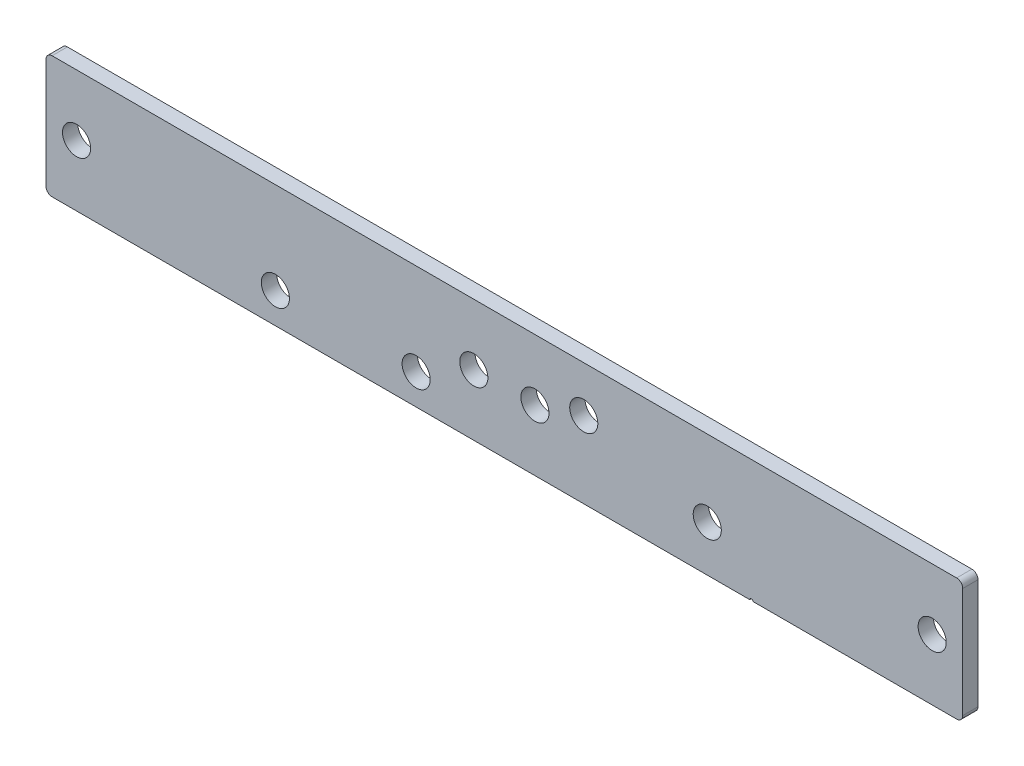
ISO-10303-21;
HEADER;
FILE_DESCRIPTION(('STEP AP214'),'2;1');
FILE_NAME('part.step','',(''),(''),'','','');
FILE_SCHEMA(('AUTOMOTIVE_DESIGN { 1 0 10303 214 1 1 1 1 }'));
ENDSEC;
DATA;
#1=APPLICATION_CONTEXT('core data for automotive mechanical design processes');
#2=APPLICATION_PROTOCOL_DEFINITION('international standard','automotive_design',2000,#1);
#3=PRODUCT_CONTEXT('',#1,'mechanical');
#4=PRODUCT('Part','Part','',(#3));
#5=PRODUCT_RELATED_PRODUCT_CATEGORY('part','',(#4));
#6=PRODUCT_DEFINITION_FORMATION('','',#4);
#7=PRODUCT_DEFINITION_CONTEXT('part definition',#1,'design');
#8=PRODUCT_DEFINITION('design','',#6,#7);
#9=PRODUCT_DEFINITION_SHAPE('','',#8);
#10=(LENGTH_UNIT() NAMED_UNIT(*) SI_UNIT(.MILLI.,.METRE.));
#11=(NAMED_UNIT(*) PLANE_ANGLE_UNIT() SI_UNIT($,.RADIAN.));
#12=(NAMED_UNIT(*) SI_UNIT($,.STERADIAN.) SOLID_ANGLE_UNIT());
#13=UNCERTAINTY_MEASURE_WITH_UNIT(LENGTH_MEASURE(1.E-05),#10,'distance_accuracy_value','');
#14=(GEOMETRIC_REPRESENTATION_CONTEXT(3) GLOBAL_UNCERTAINTY_ASSIGNED_CONTEXT((#13)) GLOBAL_UNIT_ASSIGNED_CONTEXT((#10,
#11,#12)) REPRESENTATION_CONTEXT('',''));
#15=CARTESIAN_POINT('',(0.,0.,0.));
#16=DIRECTION('',(0.,0.,1.));
#17=DIRECTION('',(1.,0.,0.));
#18=AXIS2_PLACEMENT_3D('',#15,#16,#17);
#19=CARTESIAN_POINT('',(-150.,-20.,5.));
#20=DIRECTION('',(0.,1.,0.));
#21=DIRECTION('',(-1.,0.,0.));
#22=AXIS2_PLACEMENT_3D('',#19,#20,#21);
#23=PLANE('',#22);
#24=DIRECTION('',(1.,0.,0.));
#25=VECTOR('',#24,1.);
#26=CARTESIAN_POINT('',(-150.,-20.,5.));
#27=LINE('',#26,#25);
#28=CARTESIAN_POINT('',(81.3290376865498,-20.,5.));
#29=VERTEX_POINT('',#28);
#30=CARTESIAN_POINT('',(148.,-19.9999999999999,5.));
#31=VERTEX_POINT('',#30);
#32=EDGE_CURVE('E117',#29,#31,#27,.T.);
#33=ORIENTED_EDGE('',*,*,#32,.F.);
#34=DIRECTION('',(0.,0.,-1.));
#35=VECTOR('',#34,1.);
#36=CARTESIAN_POINT('',(81.3290376865498,-20.,5.));
#37=LINE('',#36,#35);
#38=CARTESIAN_POINT('',(81.3290376865498,-20.,0.));
#39=VERTEX_POINT('',#38);
#40=EDGE_CURVE('E95',#29,#39,#37,.T.);
#41=ORIENTED_EDGE('',*,*,#40,.T.);
#42=DIRECTION('',(1.,0.,0.));
#43=VECTOR('',#42,1.);
#44=CARTESIAN_POINT('',(-150.,-20.,0.));
#45=LINE('',#44,#43);
#46=CARTESIAN_POINT('',(148.,-19.9999999999999,0.));
#47=VERTEX_POINT('',#46);
#48=EDGE_CURVE('E131',#39,#47,#45,.T.);
#49=ORIENTED_EDGE('',*,*,#48,.T.);
#50=DIRECTION('',(0.,0.,-1.));
#51=VECTOR('',#50,1.);
#52=CARTESIAN_POINT('',(148.,-19.9999999999999,5.));
#53=LINE('',#52,#51);
#54=EDGE_CURVE('E154',#47,#31,#53,.F.);
#55=ORIENTED_EDGE('',*,*,#54,.T.);
#56=EDGE_LOOP('',(#33,#41,#49,#55));
#57=FACE_BOUND('',#56,.T.);
#58=ADVANCED_FACE('F16',(#57),#23,.F.);
#59=CARTESIAN_POINT('',(-150.,20.,5.));
#60=DIRECTION('',(1.,0.,0.));
#61=DIRECTION('',(0.,1.,0.));
#62=AXIS2_PLACEMENT_3D('',#59,#60,#61);
#63=PLANE('',#62);
#64=DIRECTION('',(0.,-1.,0.));
#65=VECTOR('',#64,1.);
#66=CARTESIAN_POINT('',(-150.,20.,0.));
#67=LINE('',#66,#65);
#68=CARTESIAN_POINT('',(-150.,18.,0.));
#69=VERTEX_POINT('',#68);
#70=CARTESIAN_POINT('',(-150.,-18.,0.));
#71=VERTEX_POINT('',#70);
#72=EDGE_CURVE('E128',#69,#71,#67,.T.);
#73=ORIENTED_EDGE('',*,*,#72,.T.);
#74=DIRECTION('',(0.,0.,-1.));
#75=VECTOR('',#74,1.);
#76=CARTESIAN_POINT('',(-150.,-18.,5.));
#77=LINE('',#76,#75);
#78=CARTESIAN_POINT('',(-150.,-18.,5.));
#79=VERTEX_POINT('',#78);
#80=EDGE_CURVE('E10',#71,#79,#77,.F.);
#81=ORIENTED_EDGE('',*,*,#80,.T.);
#82=DIRECTION('',(0.,-1.,0.));
#83=VECTOR('',#82,1.);
#84=CARTESIAN_POINT('',(-150.,20.,5.));
#85=LINE('',#84,#83);
#86=CARTESIAN_POINT('',(-150.,18.,5.));
#87=VERTEX_POINT('',#86);
#88=EDGE_CURVE('E122',#87,#79,#85,.T.);
#89=ORIENTED_EDGE('',*,*,#88,.F.);
#90=DIRECTION('',(0.,0.,-1.));
#91=VECTOR('',#90,1.);
#92=CARTESIAN_POINT('',(-150.,18.,5.));
#93=LINE('',#92,#91);
#94=EDGE_CURVE('E24',#87,#69,#93,.T.);
#95=ORIENTED_EDGE('',*,*,#94,.T.);
#96=EDGE_LOOP('',(#73,#81,#89,#95));
#97=FACE_BOUND('',#96,.T.);
#98=ADVANCED_FACE('F172',(#97),#63,.F.);
#99=CARTESIAN_POINT('',(-148.,-20.,0.));
#100=VERTEX_POINT('',#99);
#101=CARTESIAN_POINT('',(80.3290376865498,-20.,0.));
#102=VERTEX_POINT('',#101);
#103=EDGE_CURVE('E109',#100,#102,#45,.T.);
#104=ORIENTED_EDGE('',*,*,#103,.T.);
#105=DIRECTION('',(0.,0.,-1.));
#106=VECTOR('',#105,1.);
#107=CARTESIAN_POINT('',(80.3290376865498,-20.,5.));
#108=LINE('',#107,#106);
#109=CARTESIAN_POINT('',(80.3290376865498,-20.,5.));
#110=VERTEX_POINT('',#109);
#111=EDGE_CURVE('E31',#102,#110,#108,.F.);
#112=ORIENTED_EDGE('',*,*,#111,.T.);
#113=CARTESIAN_POINT('',(-148.,-20.,5.));
#114=VERTEX_POINT('',#113);
#115=EDGE_CURVE('E106',#114,#110,#27,.T.);
#116=ORIENTED_EDGE('',*,*,#115,.F.);
#117=DIRECTION('',(0.,0.,-1.));
#118=VECTOR('',#117,1.);
#119=CARTESIAN_POINT('',(-148.,-20.,5.));
#120=LINE('',#119,#118);
#121=EDGE_CURVE('E152',#114,#100,#120,.T.);
#122=ORIENTED_EDGE('',*,*,#121,.T.);
#123=EDGE_LOOP('',(#104,#112,#116,#122));
#124=FACE_BOUND('',#123,.T.);
#125=ADVANCED_FACE('F104',(#124),#23,.F.);
#126=CARTESIAN_POINT('',(150.,20.,5.));
#127=DIRECTION('',(-1.,0.,0.));
#128=DIRECTION('',(0.,0.,1.));
#129=AXIS2_PLACEMENT_3D('',#126,#127,#128);
#130=PLANE('',#129);
#131=DIRECTION('',(0.,1.,0.));
#132=VECTOR('',#131,1.);
#133=CARTESIAN_POINT('',(150.,20.,5.));
#134=LINE('',#133,#132);
#135=CARTESIAN_POINT('',(150.,-17.9999999999999,5.));
#136=VERTEX_POINT('',#135);
#137=CARTESIAN_POINT('',(150.,18.,5.));
#138=VERTEX_POINT('',#137);
#139=EDGE_CURVE('E116',#136,#138,#134,.T.);
#140=ORIENTED_EDGE('',*,*,#139,.F.);
#141=DIRECTION('',(0.,0.,-1.));
#142=VECTOR('',#141,1.);
#143=CARTESIAN_POINT('',(150.,-17.9999999999999,5.));
#144=LINE('',#143,#142);
#145=CARTESIAN_POINT('',(150.,-17.9999999999999,0.));
#146=VERTEX_POINT('',#145);
#147=EDGE_CURVE('E140',#136,#146,#144,.T.);
#148=ORIENTED_EDGE('',*,*,#147,.T.);
#149=DIRECTION('',(0.,1.,0.));
#150=VECTOR('',#149,1.);
#151=CARTESIAN_POINT('',(150.,20.,0.));
#152=LINE('',#151,#150);
#153=CARTESIAN_POINT('',(150.,18.,0.));
#154=VERTEX_POINT('',#153);
#155=EDGE_CURVE('E134',#146,#154,#152,.T.);
#156=ORIENTED_EDGE('',*,*,#155,.T.);
#157=DIRECTION('',(0.,0.,-1.));
#158=VECTOR('',#157,1.);
#159=CARTESIAN_POINT('',(150.,18.,5.));
#160=LINE('',#159,#158);
#161=EDGE_CURVE('E127',#154,#138,#160,.F.);
#162=ORIENTED_EDGE('',*,*,#161,.T.);
#163=EDGE_LOOP('',(#140,#148,#156,#162));
#164=FACE_BOUND('',#163,.T.);
#165=ADVANCED_FACE('F202',(#164),#130,.F.);
#166=CARTESIAN_POINT('',(-150.,20.,5.));
#167=DIRECTION('',(0.,-1.,0.));
#168=DIRECTION('',(1.,0.,0.));
#169=AXIS2_PLACEMENT_3D('',#166,#167,#168);
#170=PLANE('',#169);
#171=DIRECTION('',(-1.,0.,0.));
#172=VECTOR('',#171,1.);
#173=CARTESIAN_POINT('',(-150.,20.,5.));
#174=LINE('',#173,#172);
#175=CARTESIAN_POINT('',(148.,20.,5.));
#176=VERTEX_POINT('',#175);
#177=CARTESIAN_POINT('',(-148.,20.,5.));
#178=VERTEX_POINT('',#177);
#179=EDGE_CURVE('E120',#176,#178,#174,.T.);
#180=ORIENTED_EDGE('',*,*,#179,.F.);
#181=DIRECTION('',(0.,0.,-1.));
#182=VECTOR('',#181,1.);
#183=CARTESIAN_POINT('',(148.,20.,5.));
#184=LINE('',#183,#182);
#185=CARTESIAN_POINT('',(148.,20.,0.));
#186=VERTEX_POINT('',#185);
#187=EDGE_CURVE('E165',#176,#186,#184,.T.);
#188=ORIENTED_EDGE('',*,*,#187,.T.);
#189=DIRECTION('',(-1.,0.,0.));
#190=VECTOR('',#189,1.);
#191=CARTESIAN_POINT('',(-150.,20.,0.));
#192=LINE('',#191,#190);
#193=CARTESIAN_POINT('',(-148.,20.,0.));
#194=VERTEX_POINT('',#193);
#195=EDGE_CURVE('E137',#186,#194,#192,.T.);
#196=ORIENTED_EDGE('',*,*,#195,.T.);
#197=DIRECTION('',(0.,0.,-1.));
#198=VECTOR('',#197,1.);
#199=CARTESIAN_POINT('',(-148.,20.,5.));
#200=LINE('',#199,#198);
#201=EDGE_CURVE('E39',#194,#178,#200,.F.);
#202=ORIENTED_EDGE('',*,*,#201,.T.);
#203=EDGE_LOOP('',(#180,#188,#196,#202));
#204=FACE_BOUND('',#203,.T.);
#205=ADVANCED_FACE('F206',(#204),#170,.F.);
#206=CARTESIAN_POINT('',(0.,0.,5.));
#207=DIRECTION('',(0.,0.,1.));
#208=DIRECTION('',(1.,0.,0.));
#209=AXIS2_PLACEMENT_3D('',#206,#207,#208);
#210=PLANE('',#209);
#211=CARTESIAN_POINT('',(80.8290376865498,-20.,5.));
#212=DIRECTION('',(0.,0.,-1.));
#213=DIRECTION('',(-1.,0.,0.));
#214=AXIS2_PLACEMENT_3D('',#211,#212,#213);
#215=CIRCLE('',#214,0.499999999999999);
#216=EDGE_CURVE('E92',#110,#29,#215,.T.);
#217=ORIENTED_EDGE('',*,*,#216,.T.);
#218=ORIENTED_EDGE('',*,*,#32,.T.);
#219=CARTESIAN_POINT('',(148.,-17.9999999999999,5.));
#220=DIRECTION('',(0.,0.,1.));
#221=DIRECTION('',(1.,0.,0.));
#222=AXIS2_PLACEMENT_3D('',#219,#220,#221);
#223=CIRCLE('',#222,2.);
#224=EDGE_CURVE('E162',#31,#136,#223,.T.);
#225=ORIENTED_EDGE('',*,*,#224,.T.);
#226=ORIENTED_EDGE('',*,*,#139,.T.);
#227=CARTESIAN_POINT('',(148.,18.,5.));
#228=DIRECTION('',(0.,0.,1.));
#229=DIRECTION('',(1.,0.,0.));
#230=AXIS2_PLACEMENT_3D('',#227,#228,#229);
#231=CIRCLE('',#230,2.);
#232=EDGE_CURVE('E160',#138,#176,#231,.T.);
#233=ORIENTED_EDGE('',*,*,#232,.T.);
#234=ORIENTED_EDGE('',*,*,#179,.T.);
#235=CARTESIAN_POINT('',(-148.,18.,5.));
#236=DIRECTION('',(0.,0.,1.));
#237=DIRECTION('',(1.,0.,0.));
#238=AXIS2_PLACEMENT_3D('',#235,#236,#237);
#239=CIRCLE('',#238,2.);
#240=EDGE_CURVE('E157',#178,#87,#239,.T.);
#241=ORIENTED_EDGE('',*,*,#240,.T.);
#242=ORIENTED_EDGE('',*,*,#88,.T.);
#243=CARTESIAN_POINT('',(-148.,-18.,5.));
#244=DIRECTION('',(0.,0.,1.));
#245=DIRECTION('',(1.,0.,0.));
#246=AXIS2_PLACEMENT_3D('',#243,#244,#245);
#247=CIRCLE('',#246,2.);
#248=EDGE_CURVE('E115',#79,#114,#247,.T.);
#249=ORIENTED_EDGE('',*,*,#248,.T.);
#250=ORIENTED_EDGE('',*,*,#115,.T.);
#251=EDGE_LOOP('',(#217,#218,#225,#226,#233,#234,#241,#242,#249,#250));
#252=FACE_BOUND('',#251,.T.);
#253=CARTESIAN_POINT('',(-9.99999999999995,0.,5.));
#254=DIRECTION('',(0.,0.,1.));
#255=DIRECTION('',(1.,0.,0.));
#256=AXIS2_PLACEMENT_3D('',#253,#254,#255);
#257=CIRCLE('',#256,4.6);
#258=CARTESIAN_POINT('',(-5.39999999999995,0.,5.));
#259=VERTEX_POINT('',#258);
#260=EDGE_CURVE('E387',#259,#259,#257,.T.);
#261=ORIENTED_EDGE('',*,*,#260,.F.);
#262=EDGE_LOOP('',(#261));
#263=FACE_BOUND('',#262,.T.);
#264=CARTESIAN_POINT('',(10.,0.,5.));
#265=DIRECTION('',(0.,0.,1.));
#266=DIRECTION('',(1.,0.,0.));
#267=AXIS2_PLACEMENT_3D('',#264,#265,#266);
#268=CIRCLE('',#267,4.6);
#269=CARTESIAN_POINT('',(14.6000000000001,0.,5.));
#270=VERTEX_POINT('',#269);
#271=EDGE_CURVE('E395',#270,#270,#268,.T.);
#272=ORIENTED_EDGE('',*,*,#271,.F.);
#273=EDGE_LOOP('',(#272));
#274=FACE_BOUND('',#273,.T.);
#275=CARTESIAN_POINT('',(140.,0.,5.));
#276=DIRECTION('',(0.,0.,1.));
#277=DIRECTION('',(1.,0.,0.));
#278=AXIS2_PLACEMENT_3D('',#275,#276,#277);
#279=CIRCLE('',#278,4.59999999999999);
#280=CARTESIAN_POINT('',(144.6,0.,5.));
#281=VERTEX_POINT('',#280);
#282=EDGE_CURVE('E380',#281,#281,#279,.T.);
#283=ORIENTED_EDGE('',*,*,#282,.F.);
#284=EDGE_LOOP('',(#283));
#285=FACE_BOUND('',#284,.T.);
#286=CARTESIAN_POINT('',(-140.,0.,5.));
#287=DIRECTION('',(0.,0.,1.));
#288=DIRECTION('',(1.,0.,0.));
#289=AXIS2_PLACEMENT_3D('',#286,#287,#288);
#290=CIRCLE('',#289,4.59999999999999);
#291=CARTESIAN_POINT('',(-135.4,0.,5.));
#292=VERTEX_POINT('',#291);
#293=EDGE_CURVE('E394',#292,#292,#290,.T.);
#294=ORIENTED_EDGE('',*,*,#293,.F.);
#295=EDGE_LOOP('',(#294));
#296=FACE_BOUND('',#295,.T.);
#297=CARTESIAN_POINT('',(66.3952809568076,-5.00000000000004,5.));
#298=DIRECTION('',(0.,0.,-1.));
#299=DIRECTION('',(-1.,0.,0.));
#300=AXIS2_PLACEMENT_3D('',#297,#298,#299);
#301=CIRCLE('',#300,4.6);
#302=CARTESIAN_POINT('',(61.7952809568076,-5.00000000000004,5.));
#303=VERTEX_POINT('',#302);
#304=EDGE_CURVE('E408',#303,#303,#301,.T.);
#305=ORIENTED_EDGE('',*,*,#304,.T.);
#306=EDGE_LOOP('',(#305));
#307=FACE_BOUND('',#306,.T.);
#308=CARTESIAN_POINT('',(25.9807621135338,4.99999999999997,5.));
#309=DIRECTION('',(0.,0.,-1.));
#310=DIRECTION('',(-1.,0.,0.));
#311=AXIS2_PLACEMENT_3D('',#308,#309,#310);
#312=CIRCLE('',#311,4.6);
#313=CARTESIAN_POINT('',(21.3807621135338,4.99999999999997,5.));
#314=VERTEX_POINT('',#313);
#315=EDGE_CURVE('E415',#314,#314,#312,.T.);
#316=ORIENTED_EDGE('',*,*,#315,.T.);
#317=EDGE_LOOP('',(#316));
#318=FACE_BOUND('',#317,.T.);
#319=CARTESIAN_POINT('',(-74.9352031786142,-10.,5.));
#320=DIRECTION('',(0.,0.,-1.));
#321=DIRECTION('',(-1.,0.,0.));
#322=AXIS2_PLACEMENT_3D('',#319,#320,#321);
#323=CIRCLE('',#322,4.6);
#324=CARTESIAN_POINT('',(-79.5352031786142,-10.,5.));
#325=VERTEX_POINT('',#324);
#326=EDGE_CURVE('E421',#325,#325,#323,.T.);
#327=ORIENTED_EDGE('',*,*,#326,.T.);
#328=EDGE_LOOP('',(#327));
#329=FACE_BOUND('',#328,.T.);
#330=CARTESIAN_POINT('',(-28.8675134594806,-10.,5.));
#331=DIRECTION('',(0.,0.,-1.));
#332=DIRECTION('',(-1.,0.,0.));
#333=AXIS2_PLACEMENT_3D('',#330,#331,#332);
#334=CIRCLE('',#333,4.6);
#335=CARTESIAN_POINT('',(-33.4675134594806,-10.,5.));
#336=VERTEX_POINT('',#335);
#337=EDGE_CURVE('E132',#336,#336,#334,.T.);
#338=ORIENTED_EDGE('',*,*,#337,.T.);
#339=EDGE_LOOP('',(#338));
#340=FACE_BOUND('',#339,.T.);
#341=ADVANCED_FACE('F111',(#252,#263,#274,#285,#296,#307,#318,#329,#340),#210,.T.);
#342=CARTESIAN_POINT('',(0.,0.,0.));
#343=DIRECTION('',(0.,0.,1.));
#344=DIRECTION('',(1.,0.,0.));
#345=AXIS2_PLACEMENT_3D('',#342,#343,#344);
#346=PLANE('',#345);
#347=CARTESIAN_POINT('',(-9.99999999999995,0.,0.));
#348=DIRECTION('',(0.,0.,1.));
#349=DIRECTION('',(1.,0.,0.));
#350=AXIS2_PLACEMENT_3D('',#347,#348,#349);
#351=CIRCLE('',#350,4.6);
#352=CARTESIAN_POINT('',(-5.39999999999995,0.,0.));
#353=VERTEX_POINT('',#352);
#354=EDGE_CURVE('E390',#353,#353,#351,.F.);
#355=ORIENTED_EDGE('',*,*,#354,.F.);
#356=EDGE_LOOP('',(#355));
#357=FACE_BOUND('',#356,.T.);
#358=CARTESIAN_POINT('',(10.,0.,0.));
#359=DIRECTION('',(0.,0.,1.));
#360=DIRECTION('',(1.,0.,0.));
#361=AXIS2_PLACEMENT_3D('',#358,#359,#360);
#362=CIRCLE('',#361,4.6);
#363=CARTESIAN_POINT('',(14.6000000000001,0.,0.));
#364=VERTEX_POINT('',#363);
#365=EDGE_CURVE('E391',#364,#364,#362,.F.);
#366=ORIENTED_EDGE('',*,*,#365,.F.);
#367=EDGE_LOOP('',(#366));
#368=FACE_BOUND('',#367,.T.);
#369=CARTESIAN_POINT('',(140.,0.,0.));
#370=DIRECTION('',(0.,0.,1.));
#371=DIRECTION('',(1.,0.,0.));
#372=AXIS2_PLACEMENT_3D('',#369,#370,#371);
#373=CIRCLE('',#372,4.59999999999999);
#374=CARTESIAN_POINT('',(144.6,0.,0.));
#375=VERTEX_POINT('',#374);
#376=EDGE_CURVE('E383',#375,#375,#373,.F.);
#377=ORIENTED_EDGE('',*,*,#376,.F.);
#378=EDGE_LOOP('',(#377));
#379=FACE_BOUND('',#378,.T.);
#380=CARTESIAN_POINT('',(-140.,0.,0.));
#381=DIRECTION('',(0.,0.,1.));
#382=DIRECTION('',(1.,0.,0.));
#383=AXIS2_PLACEMENT_3D('',#380,#381,#382);
#384=CIRCLE('',#383,4.59999999999999);
#385=CARTESIAN_POINT('',(-135.4,0.,0.));
#386=VERTEX_POINT('',#385);
#387=EDGE_CURVE('E404',#386,#386,#384,.F.);
#388=ORIENTED_EDGE('',*,*,#387,.F.);
#389=EDGE_LOOP('',(#388));
#390=FACE_BOUND('',#389,.T.);
#391=CARTESIAN_POINT('',(66.3952809568076,-5.00000000000004,0.));
#392=DIRECTION('',(0.,0.,-1.));
#393=DIRECTION('',(-1.,0.,0.));
#394=AXIS2_PLACEMENT_3D('',#391,#392,#393);
#395=CIRCLE('',#394,4.6);
#396=CARTESIAN_POINT('',(61.7952809568076,-5.00000000000004,0.));
#397=VERTEX_POINT('',#396);
#398=EDGE_CURVE('E412',#397,#397,#395,.T.);
#399=ORIENTED_EDGE('',*,*,#398,.F.);
#400=EDGE_LOOP('',(#399));
#401=FACE_BOUND('',#400,.T.);
#402=CARTESIAN_POINT('',(25.9807621135338,4.99999999999997,0.));
#403=DIRECTION('',(0.,0.,-1.));
#404=DIRECTION('',(-1.,0.,0.));
#405=AXIS2_PLACEMENT_3D('',#402,#403,#404);
#406=CIRCLE('',#405,4.6);
#407=CARTESIAN_POINT('',(21.3807621135338,4.99999999999997,0.));
#408=VERTEX_POINT('',#407);
#409=EDGE_CURVE('E418',#408,#408,#406,.T.);
#410=ORIENTED_EDGE('',*,*,#409,.F.);
#411=EDGE_LOOP('',(#410));
#412=FACE_BOUND('',#411,.T.);
#413=CARTESIAN_POINT('',(-74.9352031786142,-10.,0.));
#414=DIRECTION('',(0.,0.,-1.));
#415=DIRECTION('',(-1.,0.,0.));
#416=AXIS2_PLACEMENT_3D('',#413,#414,#415);
#417=CIRCLE('',#416,4.6);
#418=CARTESIAN_POINT('',(-79.5352031786142,-10.,0.));
#419=VERTEX_POINT('',#418);
#420=EDGE_CURVE('E407',#419,#419,#417,.T.);
#421=ORIENTED_EDGE('',*,*,#420,.F.);
#422=EDGE_LOOP('',(#421));
#423=FACE_BOUND('',#422,.T.);
#424=CARTESIAN_POINT('',(-28.8675134594806,-10.,0.));
#425=DIRECTION('',(0.,0.,-1.));
#426=DIRECTION('',(-1.,0.,0.));
#427=AXIS2_PLACEMENT_3D('',#424,#425,#426);
#428=CIRCLE('',#427,4.6);
#429=CARTESIAN_POINT('',(-33.4675134594806,-10.,0.));
#430=VERTEX_POINT('',#429);
#431=EDGE_CURVE('E411',#430,#430,#428,.T.);
#432=ORIENTED_EDGE('',*,*,#431,.F.);
#433=EDGE_LOOP('',(#432));
#434=FACE_BOUND('',#433,.T.);
#435=ORIENTED_EDGE('',*,*,#48,.F.);
#436=CARTESIAN_POINT('',(80.8290376865498,-20.,0.));
#437=DIRECTION('',(0.,0.,-1.));
#438=DIRECTION('',(-1.,0.,0.));
#439=AXIS2_PLACEMENT_3D('',#436,#437,#438);
#440=CIRCLE('',#439,0.499999999999999);
#441=EDGE_CURVE('E99',#102,#39,#440,.T.);
#442=ORIENTED_EDGE('',*,*,#441,.F.);
#443=ORIENTED_EDGE('',*,*,#103,.F.);
#444=CARTESIAN_POINT('',(-148.,-18.,0.));
#445=DIRECTION('',(0.,0.,1.));
#446=DIRECTION('',(1.,0.,0.));
#447=AXIS2_PLACEMENT_3D('',#444,#445,#446);
#448=CIRCLE('',#447,2.);
#449=EDGE_CURVE('E145',#100,#71,#448,.F.);
#450=ORIENTED_EDGE('',*,*,#449,.T.);
#451=ORIENTED_EDGE('',*,*,#72,.F.);
#452=CARTESIAN_POINT('',(-148.,18.,0.));
#453=DIRECTION('',(0.,0.,1.));
#454=DIRECTION('',(1.,0.,0.));
#455=AXIS2_PLACEMENT_3D('',#452,#453,#454);
#456=CIRCLE('',#455,2.);
#457=EDGE_CURVE('E143',#69,#194,#456,.F.);
#458=ORIENTED_EDGE('',*,*,#457,.T.);
#459=ORIENTED_EDGE('',*,*,#195,.F.);
#460=CARTESIAN_POINT('',(148.,18.,0.));
#461=DIRECTION('',(0.,0.,1.));
#462=DIRECTION('',(1.,0.,0.));
#463=AXIS2_PLACEMENT_3D('',#460,#461,#462);
#464=CIRCLE('',#463,2.);
#465=EDGE_CURVE('E147',#186,#154,#464,.F.);
#466=ORIENTED_EDGE('',*,*,#465,.T.);
#467=ORIENTED_EDGE('',*,*,#155,.F.);
#468=CARTESIAN_POINT('',(148.,-17.9999999999999,0.));
#469=DIRECTION('',(0.,0.,1.));
#470=DIRECTION('',(1.,0.,0.));
#471=AXIS2_PLACEMENT_3D('',#468,#469,#470);
#472=CIRCLE('',#471,2.);
#473=EDGE_CURVE('E149',#146,#47,#472,.F.);
#474=ORIENTED_EDGE('',*,*,#473,.T.);
#475=EDGE_LOOP('',(#435,#442,#443,#450,#451,#458,#459,#466,#467,#474));
#476=FACE_BOUND('',#475,.T.);
#477=ADVANCED_FACE('F178',(#357,#368,#379,#390,#401,#412,#423,#434,#476),#346,.F.);
#478=CARTESIAN_POINT('',(-28.8675134594806,-10.,5.));
#479=DIRECTION('',(0.,0.,-1.));
#480=DIRECTION('',(-1.,0.,0.));
#481=AXIS2_PLACEMENT_3D('',#478,#479,#480);
#482=CYLINDRICAL_SURFACE('',#481,4.6);
#483=ORIENTED_EDGE('',*,*,#337,.F.);
#484=EDGE_LOOP('',(#483));
#485=FACE_BOUND('',#484,.T.);
#486=ORIENTED_EDGE('',*,*,#431,.T.);
#487=EDGE_LOOP('',(#486));
#488=FACE_BOUND('',#487,.T.);
#489=ADVANCED_FACE('F216',(#485,#488),#482,.F.);
#490=CARTESIAN_POINT('',(-74.9352031786142,-10.,5.));
#491=DIRECTION('',(0.,0.,-1.));
#492=DIRECTION('',(-1.,0.,0.));
#493=AXIS2_PLACEMENT_3D('',#490,#491,#492);
#494=CYLINDRICAL_SURFACE('',#493,4.6);
#495=ORIENTED_EDGE('',*,*,#326,.F.);
#496=EDGE_LOOP('',(#495));
#497=FACE_BOUND('',#496,.T.);
#498=ORIENTED_EDGE('',*,*,#420,.T.);
#499=EDGE_LOOP('',(#498));
#500=FACE_BOUND('',#499,.T.);
#501=ADVANCED_FACE('F222',(#497,#500),#494,.F.);
#502=CARTESIAN_POINT('',(25.9807621135338,4.99999999999997,5.));
#503=DIRECTION('',(0.,0.,-1.));
#504=DIRECTION('',(-1.,0.,0.));
#505=AXIS2_PLACEMENT_3D('',#502,#503,#504);
#506=CYLINDRICAL_SURFACE('',#505,4.6);
#507=ORIENTED_EDGE('',*,*,#315,.F.);
#508=EDGE_LOOP('',(#507));
#509=FACE_BOUND('',#508,.T.);
#510=ORIENTED_EDGE('',*,*,#409,.T.);
#511=EDGE_LOOP('',(#510));
#512=FACE_BOUND('',#511,.T.);
#513=ADVANCED_FACE('F226',(#509,#512),#506,.F.);
#514=CARTESIAN_POINT('',(66.3952809568076,-5.00000000000004,5.));
#515=DIRECTION('',(0.,0.,-1.));
#516=DIRECTION('',(-1.,0.,0.));
#517=AXIS2_PLACEMENT_3D('',#514,#515,#516);
#518=CYLINDRICAL_SURFACE('',#517,4.6);
#519=ORIENTED_EDGE('',*,*,#304,.F.);
#520=EDGE_LOOP('',(#519));
#521=FACE_BOUND('',#520,.T.);
#522=ORIENTED_EDGE('',*,*,#398,.T.);
#523=EDGE_LOOP('',(#522));
#524=FACE_BOUND('',#523,.T.);
#525=ADVANCED_FACE('F230',(#521,#524),#518,.F.);
#526=CARTESIAN_POINT('',(148.,-17.9999999999999,5.));
#527=DIRECTION('',(0.,0.,-1.));
#528=DIRECTION('',(-1.,0.,0.));
#529=AXIS2_PLACEMENT_3D('',#526,#527,#528);
#530=CYLINDRICAL_SURFACE('',#529,2.);
#531=ORIENTED_EDGE('',*,*,#224,.F.);
#532=ORIENTED_EDGE('',*,*,#54,.F.);
#533=ORIENTED_EDGE('',*,*,#473,.F.);
#534=ORIENTED_EDGE('',*,*,#147,.F.);
#535=EDGE_LOOP('',(#531,#532,#533,#534));
#536=FACE_BOUND('',#535,.T.);
#537=ADVANCED_FACE('F233',(#536),#530,.T.);
#538=CARTESIAN_POINT('',(148.,18.,5.));
#539=DIRECTION('',(0.,0.,-1.));
#540=DIRECTION('',(-1.,0.,0.));
#541=AXIS2_PLACEMENT_3D('',#538,#539,#540);
#542=CYLINDRICAL_SURFACE('',#541,2.);
#543=ORIENTED_EDGE('',*,*,#232,.F.);
#544=ORIENTED_EDGE('',*,*,#161,.F.);
#545=ORIENTED_EDGE('',*,*,#465,.F.);
#546=ORIENTED_EDGE('',*,*,#187,.F.);
#547=EDGE_LOOP('',(#543,#544,#545,#546));
#548=FACE_BOUND('',#547,.T.);
#549=ADVANCED_FACE('F192',(#548),#542,.T.);
#550=CARTESIAN_POINT('',(-148.,-18.,5.));
#551=DIRECTION('',(0.,0.,-1.));
#552=DIRECTION('',(-1.,0.,0.));
#553=AXIS2_PLACEMENT_3D('',#550,#551,#552);
#554=CYLINDRICAL_SURFACE('',#553,2.);
#555=ORIENTED_EDGE('',*,*,#248,.F.);
#556=ORIENTED_EDGE('',*,*,#80,.F.);
#557=ORIENTED_EDGE('',*,*,#449,.F.);
#558=ORIENTED_EDGE('',*,*,#121,.F.);
#559=EDGE_LOOP('',(#555,#556,#557,#558));
#560=FACE_BOUND('',#559,.T.);
#561=ADVANCED_FACE('F181',(#560),#554,.T.);
#562=CARTESIAN_POINT('',(-148.,18.,5.));
#563=DIRECTION('',(0.,0.,-1.));
#564=DIRECTION('',(-1.,0.,0.));
#565=AXIS2_PLACEMENT_3D('',#562,#563,#564);
#566=CYLINDRICAL_SURFACE('',#565,2.);
#567=ORIENTED_EDGE('',*,*,#240,.F.);
#568=ORIENTED_EDGE('',*,*,#201,.F.);
#569=ORIENTED_EDGE('',*,*,#457,.F.);
#570=ORIENTED_EDGE('',*,*,#94,.F.);
#571=EDGE_LOOP('',(#567,#568,#569,#570));
#572=FACE_BOUND('',#571,.T.);
#573=ADVANCED_FACE('F18',(#572),#566,.T.);
#574=CARTESIAN_POINT('',(-140.,0.,-13.0107647738325));
#575=DIRECTION('',(0.,0.,1.));
#576=DIRECTION('',(1.,0.,0.));
#577=AXIS2_PLACEMENT_3D('',#574,#575,#576);
#578=CYLINDRICAL_SURFACE('',#577,4.59999999999999);
#579=ORIENTED_EDGE('',*,*,#387,.T.);
#580=EDGE_LOOP('',(#579));
#581=FACE_BOUND('',#580,.T.);
#582=ORIENTED_EDGE('',*,*,#293,.T.);
#583=EDGE_LOOP('',(#582));
#584=FACE_BOUND('',#583,.T.);
#585=ADVANCED_FACE('F183',(#581,#584),#578,.F.);
#586=CARTESIAN_POINT('',(140.,0.,-13.0107647738325));
#587=DIRECTION('',(0.,0.,1.));
#588=DIRECTION('',(1.,0.,0.));
#589=AXIS2_PLACEMENT_3D('',#586,#587,#588);
#590=CYLINDRICAL_SURFACE('',#589,4.59999999999999);
#591=ORIENTED_EDGE('',*,*,#376,.T.);
#592=EDGE_LOOP('',(#591));
#593=FACE_BOUND('',#592,.T.);
#594=ORIENTED_EDGE('',*,*,#282,.T.);
#595=EDGE_LOOP('',(#594));
#596=FACE_BOUND('',#595,.T.);
#597=ADVANCED_FACE('F189',(#593,#596),#590,.F.);
#598=CARTESIAN_POINT('',(10.,0.,-13.0107647738325));
#599=DIRECTION('',(0.,0.,1.));
#600=DIRECTION('',(1.,0.,0.));
#601=AXIS2_PLACEMENT_3D('',#598,#599,#600);
#602=CYLINDRICAL_SURFACE('',#601,4.6);
#603=ORIENTED_EDGE('',*,*,#365,.T.);
#604=EDGE_LOOP('',(#603));
#605=FACE_BOUND('',#604,.T.);
#606=ORIENTED_EDGE('',*,*,#271,.T.);
#607=EDGE_LOOP('',(#606));
#608=FACE_BOUND('',#607,.T.);
#609=ADVANCED_FACE('F238',(#605,#608),#602,.F.);
#610=CARTESIAN_POINT('',(-9.99999999999995,0.,-13.0107647738325));
#611=DIRECTION('',(0.,0.,1.));
#612=DIRECTION('',(1.,0.,0.));
#613=AXIS2_PLACEMENT_3D('',#610,#611,#612);
#614=CYLINDRICAL_SURFACE('',#613,4.6);
#615=ORIENTED_EDGE('',*,*,#354,.T.);
#616=EDGE_LOOP('',(#615));
#617=FACE_BOUND('',#616,.T.);
#618=ORIENTED_EDGE('',*,*,#260,.T.);
#619=EDGE_LOOP('',(#618));
#620=FACE_BOUND('',#619,.T.);
#621=ADVANCED_FACE('F242',(#617,#620),#614,.F.);
#622=CARTESIAN_POINT('',(80.8290376865498,-20.,5.));
#623=DIRECTION('',(0.,0.,-1.));
#624=DIRECTION('',(-1.,0.,0.));
#625=AXIS2_PLACEMENT_3D('',#622,#623,#624);
#626=CYLINDRICAL_SURFACE('',#625,0.499999999999999);
#627=ORIENTED_EDGE('',*,*,#216,.F.);
#628=ORIENTED_EDGE('',*,*,#111,.F.);
#629=ORIENTED_EDGE('',*,*,#441,.T.);
#630=ORIENTED_EDGE('',*,*,#40,.F.);
#631=EDGE_LOOP('',(#627,#628,#629,#630));
#632=FACE_BOUND('',#631,.T.);
#633=ADVANCED_FACE('F93',(#632),#626,.F.);
#634=CLOSED_SHELL('',(#58,#98,#125,#165,#205,#341,#477,#489,#501,#513,#525,#537,#549,#561,#573,
#585,#597,#609,#621,#633));
#635=MANIFOLD_SOLID_BREP('B1',#634);
#636=ADVANCED_BREP_SHAPE_REPRESENTATION('',(#18,#635),#14);
#637=SHAPE_DEFINITION_REPRESENTATION(#9,#636);
ENDSEC;
END-ISO-10303-21;
